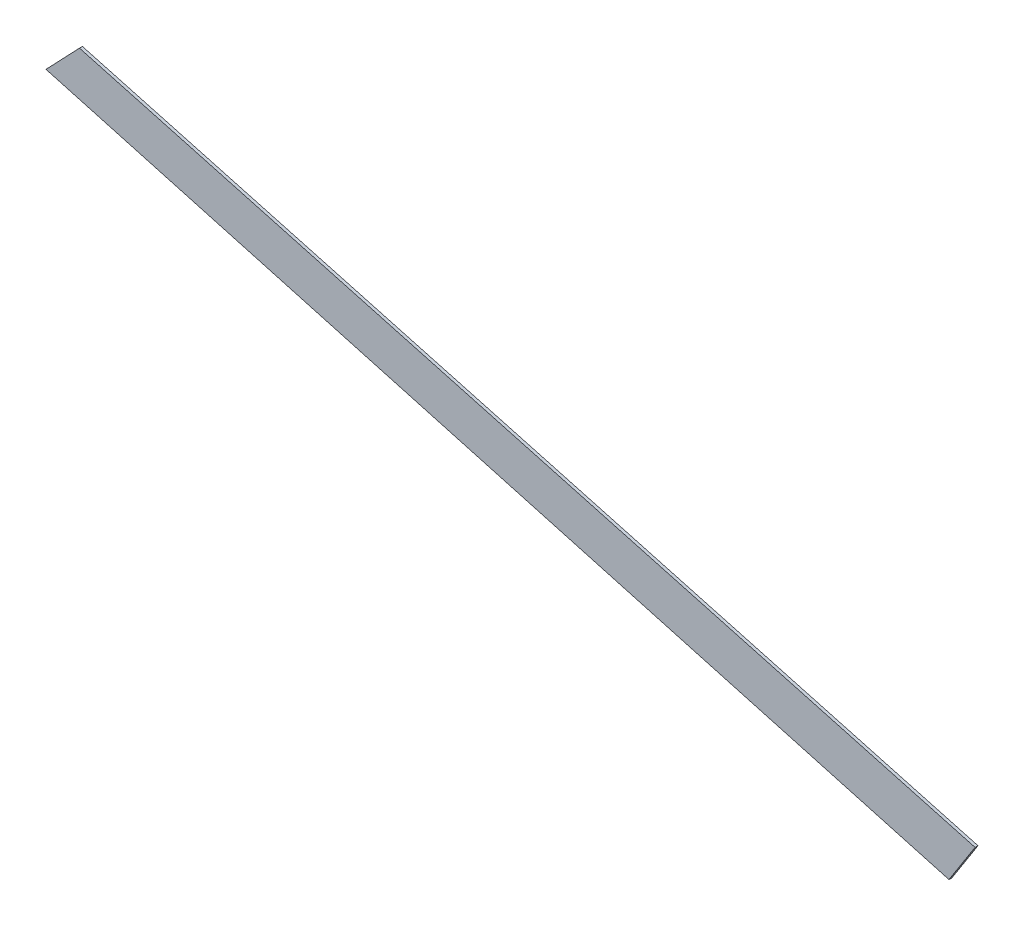
ISO-10303-21;
HEADER;
FILE_DESCRIPTION(('STEP AP214'),'2;1');
FILE_NAME('part.step','',(''),(''),'','','');
FILE_SCHEMA(('AUTOMOTIVE_DESIGN { 1 0 10303 214 1 1 1 1 }'));
ENDSEC;
DATA;
#1=APPLICATION_CONTEXT('core data for automotive mechanical design processes');
#2=APPLICATION_PROTOCOL_DEFINITION('international standard','automotive_design',2000,#1);
#3=PRODUCT_CONTEXT('',#1,'mechanical');
#4=PRODUCT('Part','Part','',(#3));
#5=PRODUCT_RELATED_PRODUCT_CATEGORY('part','',(#4));
#6=PRODUCT_DEFINITION_FORMATION('','',#4);
#7=PRODUCT_DEFINITION_CONTEXT('part definition',#1,'design');
#8=PRODUCT_DEFINITION('design','',#6,#7);
#9=PRODUCT_DEFINITION_SHAPE('','',#8);
#10=(LENGTH_UNIT() NAMED_UNIT(*) SI_UNIT(.MILLI.,.METRE.));
#11=(NAMED_UNIT(*) PLANE_ANGLE_UNIT() SI_UNIT($,.RADIAN.));
#12=(NAMED_UNIT(*) SI_UNIT($,.STERADIAN.) SOLID_ANGLE_UNIT());
#13=UNCERTAINTY_MEASURE_WITH_UNIT(LENGTH_MEASURE(1.E-05),#10,'distance_accuracy_value','');
#14=(GEOMETRIC_REPRESENTATION_CONTEXT(3) GLOBAL_UNCERTAINTY_ASSIGNED_CONTEXT((#13)) GLOBAL_UNIT_ASSIGNED_CONTEXT((#10,
#11,#12)) REPRESENTATION_CONTEXT('',''));
#15=CARTESIAN_POINT('',(0.,0.,0.));
#16=DIRECTION('',(0.,0.,1.));
#17=DIRECTION('',(1.,0.,0.));
#18=AXIS2_PLACEMENT_3D('',#15,#16,#17);
#19=CARTESIAN_POINT('',(0.,0.,3.));
#20=DIRECTION('',(0.,0.,-1.));
#21=DIRECTION('',(-1.,0.,0.));
#22=AXIS2_PLACEMENT_3D('',#19,#20,#21);
#23=PLANE('',#22);
#24=DIRECTION('',(0.537894341260186,0.843012264228861,0.));
#25=VECTOR('',#24,1.);
#26=CARTESIAN_POINT('',(-26.8947170630093,-42.150613211443,3.));
#27=LINE('',#26,#25);
#28=CARTESIAN_POINT('',(-26.8947170630093,-42.150613211443,3.));
#29=VERTEX_POINT('',#28);
#30=CARTESIAN_POINT('',(0.,0.,3.));
#31=VERTEX_POINT('',#30);
#32=EDGE_CURVE('E88',#29,#31,#27,.T.);
#33=ORIENTED_EDGE('',*,*,#32,.T.);
#34=DIRECTION('',(-0.964726124335062,0.263255588782935,0.));
#35=VECTOR('',#34,1.);
#36=CARTESIAN_POINT('',(0.,0.,3.));
#37=LINE('',#36,#35);
#38=CARTESIAN_POINT('',(-922.471738056231,251.72516262581,3.));
#39=VERTEX_POINT('',#38);
#40=EDGE_CURVE('E118',#31,#39,#37,.T.);
#41=ORIENTED_EDGE('',*,*,#40,.T.);
#42=DIRECTION('',(-0.689952918761697,-0.72385424630392,0.));
#43=VECTOR('',#42,1.);
#44=CARTESIAN_POINT('',(-922.471738056231,251.72516262581,3.));
#45=LINE('',#44,#43);
#46=CARTESIAN_POINT('',(-956.969383994316,215.532450310614,3.));
#47=VERTEX_POINT('',#46);
#48=EDGE_CURVE('E114',#39,#47,#45,.T.);
#49=ORIENTED_EDGE('',*,*,#48,.T.);
#50=DIRECTION('',(0.963696988838819,-0.26699834026262,0.));
#51=VECTOR('',#50,1.);
#52=CARTESIAN_POINT('',(-956.969383994316,215.532450310614,3.));
#53=LINE('',#52,#51);
#54=EDGE_CURVE('E109',#47,#29,#53,.T.);
#55=ORIENTED_EDGE('',*,*,#54,.T.);
#56=EDGE_LOOP('',(#33,#41,#49,#55));
#57=FACE_BOUND('',#56,.T.);
#58=ADVANCED_FACE('F78',(#57),#23,.F.);
#59=CARTESIAN_POINT('',(0.,0.,0.));
#60=DIRECTION('',(0.,0.,-1.));
#61=DIRECTION('',(-1.,0.,0.));
#62=AXIS2_PLACEMENT_3D('',#59,#60,#61);
#63=PLANE('',#62);
#64=DIRECTION('',(0.537894341260186,0.843012264228861,0.));
#65=VECTOR('',#64,1.);
#66=CARTESIAN_POINT('',(-26.8947170630093,-42.150613211443,0.));
#67=LINE('',#66,#65);
#68=CARTESIAN_POINT('',(-26.8947170630093,-42.150613211443,0.));
#69=VERTEX_POINT('',#68);
#70=CARTESIAN_POINT('',(0.,0.,0.));
#71=VERTEX_POINT('',#70);
#72=EDGE_CURVE('E12',#69,#71,#67,.T.);
#73=ORIENTED_EDGE('',*,*,#72,.F.);
#74=DIRECTION('',(0.963696988838819,-0.26699834026262,0.));
#75=VECTOR('',#74,1.);
#76=CARTESIAN_POINT('',(-956.969383994316,215.532450310614,0.));
#77=LINE('',#76,#75);
#78=CARTESIAN_POINT('',(-956.969383994316,215.532450310614,0.));
#79=VERTEX_POINT('',#78);
#80=EDGE_CURVE('E132',#79,#69,#77,.T.);
#81=ORIENTED_EDGE('',*,*,#80,.F.);
#82=DIRECTION('',(-0.689952918761697,-0.72385424630392,0.));
#83=VECTOR('',#82,1.);
#84=CARTESIAN_POINT('',(-922.471738056231,251.72516262581,0.));
#85=LINE('',#84,#83);
#86=CARTESIAN_POINT('',(-922.471738056231,251.72516262581,0.));
#87=VERTEX_POINT('',#86);
#88=EDGE_CURVE('E125',#87,#79,#85,.T.);
#89=ORIENTED_EDGE('',*,*,#88,.F.);
#90=DIRECTION('',(-0.964726124335062,0.263255588782935,0.));
#91=VECTOR('',#90,1.);
#92=CARTESIAN_POINT('',(0.,0.,0.));
#93=LINE('',#92,#91);
#94=EDGE_CURVE('E129',#71,#87,#93,.T.);
#95=ORIENTED_EDGE('',*,*,#94,.F.);
#96=EDGE_LOOP('',(#73,#81,#89,#95));
#97=FACE_BOUND('',#96,.T.);
#98=ADVANCED_FACE('F127',(#97),#63,.T.);
#99=CARTESIAN_POINT('',(-956.969383994316,215.532450310614,0.));
#100=DIRECTION('',(-0.26699834026262,-0.963696988838819,0.));
#101=DIRECTION('',(0.963696988838819,-0.26699834026262,0.));
#102=AXIS2_PLACEMENT_3D('',#99,#100,#101);
#103=PLANE('',#102);
#104=ORIENTED_EDGE('',*,*,#54,.F.);
#105=DIRECTION('',(0.,0.,1.));
#106=VECTOR('',#105,1.);
#107=CARTESIAN_POINT('',(-956.969383994316,215.532450310614,0.));
#108=LINE('',#107,#106);
#109=EDGE_CURVE('E157',#79,#47,#108,.T.);
#110=ORIENTED_EDGE('',*,*,#109,.F.);
#111=ORIENTED_EDGE('',*,*,#80,.T.);
#112=DIRECTION('',(0.,0.,1.));
#113=VECTOR('',#112,1.);
#114=CARTESIAN_POINT('',(-26.8947170630093,-42.150613211443,0.));
#115=LINE('',#114,#113);
#116=EDGE_CURVE('E172',#69,#29,#115,.T.);
#117=ORIENTED_EDGE('',*,*,#116,.T.);
#118=EDGE_LOOP('',(#104,#110,#111,#117));
#119=FACE_BOUND('',#118,.T.);
#120=ADVANCED_FACE('F186',(#119),#103,.T.);
#121=CARTESIAN_POINT('',(-922.471738056231,251.72516262581,0.));
#122=DIRECTION('',(-0.72385424630392,0.689952918761697,0.));
#123=DIRECTION('',(-0.689952918761697,-0.72385424630392,0.));
#124=AXIS2_PLACEMENT_3D('',#121,#122,#123);
#125=PLANE('',#124);
#126=ORIENTED_EDGE('',*,*,#48,.F.);
#127=DIRECTION('',(0.,0.,1.));
#128=VECTOR('',#127,1.);
#129=CARTESIAN_POINT('',(-922.471738056231,251.72516262581,0.));
#130=LINE('',#129,#128);
#131=EDGE_CURVE('E136',#87,#39,#130,.T.);
#132=ORIENTED_EDGE('',*,*,#131,.F.);
#133=ORIENTED_EDGE('',*,*,#88,.T.);
#134=ORIENTED_EDGE('',*,*,#109,.T.);
#135=EDGE_LOOP('',(#126,#132,#133,#134));
#136=FACE_BOUND('',#135,.T.);
#137=ADVANCED_FACE('F138',(#136),#125,.T.);
#138=CARTESIAN_POINT('',(0.,0.,0.));
#139=DIRECTION('',(0.263255588782935,0.964726124335062,0.));
#140=DIRECTION('',(-0.964726124335062,0.263255588782935,0.));
#141=AXIS2_PLACEMENT_3D('',#138,#139,#140);
#142=PLANE('',#141);
#143=ORIENTED_EDGE('',*,*,#40,.F.);
#144=DIRECTION('',(0.,0.,1.));
#145=VECTOR('',#144,1.);
#146=CARTESIAN_POINT('',(0.,0.,0.));
#147=LINE('',#146,#145);
#148=EDGE_CURVE('E143',#71,#31,#147,.T.);
#149=ORIENTED_EDGE('',*,*,#148,.F.);
#150=ORIENTED_EDGE('',*,*,#94,.T.);
#151=ORIENTED_EDGE('',*,*,#131,.T.);
#152=EDGE_LOOP('',(#143,#149,#150,#151));
#153=FACE_BOUND('',#152,.T.);
#154=ADVANCED_FACE('F142',(#153),#142,.T.);
#155=CARTESIAN_POINT('',(-26.8947170630093,-42.150613211443,0.));
#156=DIRECTION('',(0.84301226422886,-0.537894341260186,0.));
#157=DIRECTION('',(0.537894341260186,0.843012264228861,0.));
#158=AXIS2_PLACEMENT_3D('',#155,#156,#157);
#159=PLANE('',#158);
#160=ORIENTED_EDGE('',*,*,#32,.F.);
#161=ORIENTED_EDGE('',*,*,#116,.F.);
#162=ORIENTED_EDGE('',*,*,#72,.T.);
#163=ORIENTED_EDGE('',*,*,#148,.T.);
#164=EDGE_LOOP('',(#160,#161,#162,#163));
#165=FACE_BOUND('',#164,.T.);
#166=ADVANCED_FACE('F188',(#165),#159,.T.);
#167=CLOSED_SHELL('',(#58,#98,#120,#137,#154,#166));
#168=MANIFOLD_SOLID_BREP('B2',#167);
#169=ADVANCED_BREP_SHAPE_REPRESENTATION('',(#18,#168),#14);
#170=SHAPE_DEFINITION_REPRESENTATION(#9,#169);
ENDSEC;
END-ISO-10303-21;
